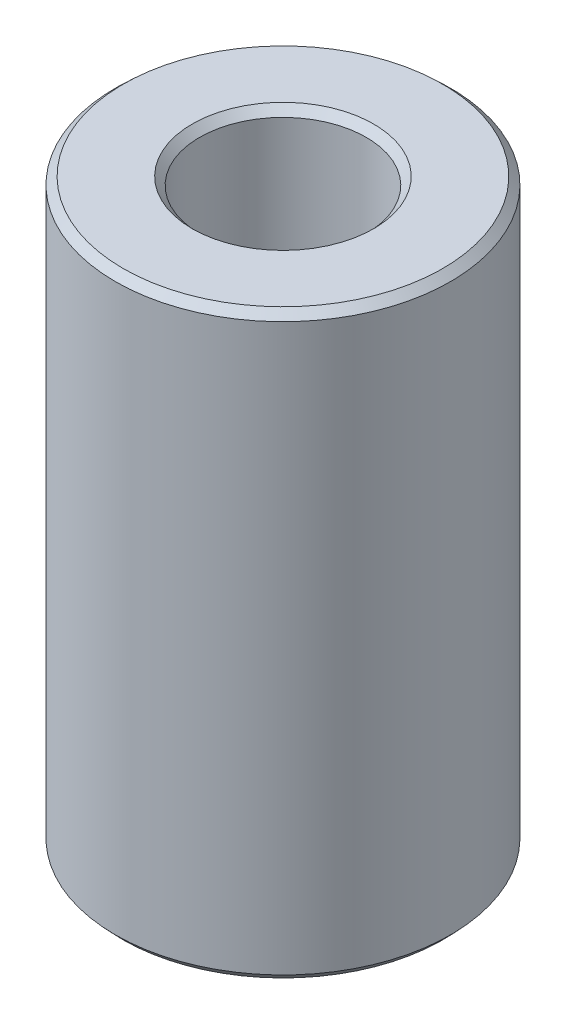
ISO-10303-21;
HEADER;
FILE_DESCRIPTION(('STEP AP214'),'2;1');
FILE_NAME('part.step','',(''),(''),'','','');
FILE_SCHEMA(('AUTOMOTIVE_DESIGN { 1 0 10303 214 1 1 1 1 }'));
ENDSEC;
DATA;
#1=APPLICATION_CONTEXT('core data for automotive mechanical design processes');
#2=APPLICATION_PROTOCOL_DEFINITION('international standard','automotive_design',2000,#1);
#3=PRODUCT_CONTEXT('',#1,'mechanical');
#4=PRODUCT('Part','Part','',(#3));
#5=PRODUCT_RELATED_PRODUCT_CATEGORY('part','',(#4));
#6=PRODUCT_DEFINITION_FORMATION('','',#4);
#7=PRODUCT_DEFINITION_CONTEXT('part definition',#1,'design');
#8=PRODUCT_DEFINITION('design','',#6,#7);
#9=PRODUCT_DEFINITION_SHAPE('','',#8);
#10=(LENGTH_UNIT() NAMED_UNIT(*) SI_UNIT(.MILLI.,.METRE.));
#11=(NAMED_UNIT(*) PLANE_ANGLE_UNIT() SI_UNIT($,.RADIAN.));
#12=(NAMED_UNIT(*) SI_UNIT($,.STERADIAN.) SOLID_ANGLE_UNIT());
#13=UNCERTAINTY_MEASURE_WITH_UNIT(LENGTH_MEASURE(1.E-05),#10,'distance_accuracy_value','');
#14=(GEOMETRIC_REPRESENTATION_CONTEXT(3) GLOBAL_UNCERTAINTY_ASSIGNED_CONTEXT((#13)) GLOBAL_UNIT_ASSIGNED_CONTEXT((#10,
#11,#12)) REPRESENTATION_CONTEXT('',''));
#15=CARTESIAN_POINT('',(0.,0.,0.));
#16=DIRECTION('',(0.,0.,1.));
#17=DIRECTION('',(1.,0.,0.));
#18=AXIS2_PLACEMENT_3D('',#15,#16,#17);
#19=CARTESIAN_POINT('',(0.,17.3345575167335,0.));
#20=DIRECTION('',(0.,-1.,0.));
#21=DIRECTION('',(0.,0.,-1.));
#22=AXIS2_PLACEMENT_3D('',#19,#20,#21);
#23=CYLINDRICAL_SURFACE('',#22,5.);
#24=CARTESIAN_POINT('',(0.,0.234252561759921,0.));
#25=DIRECTION('',(0.,1.,0.));
#26=DIRECTION('',(0.,0.,1.));
#27=AXIS2_PLACEMENT_3D('',#24,#25,#26);
#28=CIRCLE('',#27,5.);
#29=CARTESIAN_POINT('',(0.,0.234252561759921,5.));
#30=VERTEX_POINT('',#29);
#31=EDGE_CURVE('E10',#30,#30,#28,.T.);
#32=ORIENTED_EDGE('',*,*,#31,.T.);
#33=EDGE_LOOP('',(#32));
#34=FACE_BOUND('',#33,.T.);
#35=CARTESIAN_POINT('',(0.,17.1140193628233,0.));
#36=DIRECTION('',(0.,1.,0.));
#37=DIRECTION('',(0.,0.,1.));
#38=AXIS2_PLACEMENT_3D('',#35,#36,#37);
#39=CIRCLE('',#38,5.);
#40=CARTESIAN_POINT('',(0.,17.1140193628233,5.));
#41=VERTEX_POINT('',#40);
#42=EDGE_CURVE('E50',#41,#41,#39,.F.);
#43=ORIENTED_EDGE('',*,*,#42,.T.);
#44=EDGE_LOOP('',(#43));
#45=FACE_BOUND('',#44,.T.);
#46=ADVANCED_FACE('F39',(#34,#45),#23,.T.);
#47=CARTESIAN_POINT('',(0.,17.3345575167335,0.));
#48=DIRECTION('',(0.,1.,0.));
#49=DIRECTION('',(0.,0.,1.));
#50=AXIS2_PLACEMENT_3D('',#47,#48,#49);
#51=PLANE('',#50);
#52=CARTESIAN_POINT('',(0.,17.3345575167335,0.));
#53=DIRECTION('',(0.,1.,0.));
#54=DIRECTION('',(0.,0.,1.));
#55=AXIS2_PLACEMENT_3D('',#52,#53,#54);
#56=CIRCLE('',#55,2.70709384904941);
#57=CARTESIAN_POINT('',(0.,17.3345575167335,2.70709384904941));
#58=VERTEX_POINT('',#57);
#59=EDGE_CURVE('E58',#58,#58,#56,.F.);
#60=ORIENTED_EDGE('',*,*,#59,.T.);
#61=EDGE_LOOP('',(#60));
#62=FACE_BOUND('',#61,.T.);
#63=CARTESIAN_POINT('',(0.,17.3345575167335,0.));
#64=DIRECTION('',(0.,1.,0.));
#65=DIRECTION('',(0.,0.,1.));
#66=AXIS2_PLACEMENT_3D('',#63,#64,#65);
#67=CIRCLE('',#66,4.76574743824008);
#68=CARTESIAN_POINT('',(0.,17.3345575167335,4.76574743824008));
#69=VERTEX_POINT('',#68);
#70=EDGE_CURVE('E61',#69,#69,#67,.T.);
#71=ORIENTED_EDGE('',*,*,#70,.T.);
#72=EDGE_LOOP('',(#71));
#73=FACE_BOUND('',#72,.T.);
#74=ADVANCED_FACE('F88',(#62,#73),#51,.T.);
#75=CARTESIAN_POINT('',(0.,0.,0.));
#76=DIRECTION('',(0.,1.,0.));
#77=DIRECTION('',(0.,0.,1.));
#78=AXIS2_PLACEMENT_3D('',#75,#76,#77);
#79=PLANE('',#78);
#80=CARTESIAN_POINT('',(0.,0.,0.));
#81=DIRECTION('',(0.,1.,0.));
#82=DIRECTION('',(0.,0.,1.));
#83=AXIS2_PLACEMENT_3D('',#80,#81,#82);
#84=CIRCLE('',#83,2.72080825689909);
#85=CARTESIAN_POINT('',(0.,0.,2.72080825689909));
#86=VERTEX_POINT('',#85);
#87=EDGE_CURVE('E51',#86,#86,#84,.T.);
#88=ORIENTED_EDGE('',*,*,#87,.T.);
#89=EDGE_LOOP('',(#88));
#90=FACE_BOUND('',#89,.T.);
#91=CARTESIAN_POINT('',(0.,0.,0.));
#92=DIRECTION('',(0.,1.,0.));
#93=DIRECTION('',(0.,0.,1.));
#94=AXIS2_PLACEMENT_3D('',#91,#92,#93);
#95=CIRCLE('',#94,4.77946184608977);
#96=CARTESIAN_POINT('',(0.,0.,4.77946184608977));
#97=VERTEX_POINT('',#96);
#98=EDGE_CURVE('E54',#97,#97,#95,.F.);
#99=ORIENTED_EDGE('',*,*,#98,.T.);
#100=EDGE_LOOP('',(#99));
#101=FACE_BOUND('',#100,.T.);
#102=ADVANCED_FACE('F83',(#90,#101),#79,.F.);
#103=CARTESIAN_POINT('',(0.,17.3345575167335,0.));
#104=DIRECTION('',(0.,-1.,0.));
#105=DIRECTION('',(0.,0.,-1.));
#106=AXIS2_PLACEMENT_3D('',#103,#104,#105);
#107=CYLINDRICAL_SURFACE('',#106,2.48655569513917);
#108=CARTESIAN_POINT('',(0.,17.1003049549736,0.));
#109=DIRECTION('',(0.,1.,0.));
#110=DIRECTION('',(0.,0.,1.));
#111=AXIS2_PLACEMENT_3D('',#108,#109,#110);
#112=CIRCLE('',#111,2.48655569513917);
#113=CARTESIAN_POINT('',(0.,17.1003049549736,2.48655569513917));
#114=VERTEX_POINT('',#113);
#115=EDGE_CURVE('E67',#114,#114,#112,.T.);
#116=ORIENTED_EDGE('',*,*,#115,.T.);
#117=EDGE_LOOP('',(#116));
#118=FACE_BOUND('',#117,.T.);
#119=CARTESIAN_POINT('',(0.,0.220538153910228,0.));
#120=DIRECTION('',(0.,1.,0.));
#121=DIRECTION('',(0.,0.,1.));
#122=AXIS2_PLACEMENT_3D('',#119,#120,#121);
#123=CIRCLE('',#122,2.48655569513917);
#124=CARTESIAN_POINT('',(0.,0.220538153910228,2.48655569513917));
#125=VERTEX_POINT('',#124);
#126=EDGE_CURVE('E69',#125,#125,#123,.F.);
#127=ORIENTED_EDGE('',*,*,#126,.T.);
#128=EDGE_LOOP('',(#127));
#129=FACE_BOUND('',#128,.T.);
#130=ADVANCED_FACE('F71',(#118,#129),#107,.F.);
#131=CARTESIAN_POINT('',(0.,17.1003049549736,0.));
#132=DIRECTION('',(0.,1.,0.));
#133=DIRECTION('',(0.,0.,1.));
#134=AXIS2_PLACEMENT_3D('',#131,#132,#133);
#135=CONICAL_SURFACE('',#134,2.48655569513917,0.755251872851912);
#136=ORIENTED_EDGE('',*,*,#59,.F.);
#137=EDGE_LOOP('',(#136));
#138=FACE_BOUND('',#137,.T.);
#139=ORIENTED_EDGE('',*,*,#115,.F.);
#140=EDGE_LOOP('',(#139));
#141=FACE_BOUND('',#140,.T.);
#142=ADVANCED_FACE('F77',(#138,#141),#135,.F.);
#143=CARTESIAN_POINT('',(0.,0.,0.));
#144=DIRECTION('',(0.,-1.,0.));
#145=DIRECTION('',(0.,0.,-1.));
#146=AXIS2_PLACEMENT_3D('',#143,#144,#145);
#147=CONICAL_SURFACE('',#146,2.72080825689909,0.815544453942987);
#148=ORIENTED_EDGE('',*,*,#126,.F.);
#149=EDGE_LOOP('',(#148));
#150=FACE_BOUND('',#149,.T.);
#151=ORIENTED_EDGE('',*,*,#87,.F.);
#152=EDGE_LOOP('',(#151));
#153=FACE_BOUND('',#152,.T.);
#154=ADVANCED_FACE('F73',(#150,#153),#147,.F.);
#155=CARTESIAN_POINT('',(0.,0.234252561759921,0.));
#156=DIRECTION('',(0.,1.,0.));
#157=DIRECTION('',(0.,0.,1.));
#158=AXIS2_PLACEMENT_3D('',#155,#156,#157);
#159=CONICAL_SURFACE('',#158,5.,0.755251872851909);
#160=CARTESIAN_POINT('',(0.,0.,4.77946184608977));
#161=CARTESIAN_POINT('',(0.,0.0024401308516656,4.78175911852634));
#162=CARTESIAN_POINT('',(0.,0.00488026170333151,4.7840563909629));
#163=CARTESIAN_POINT('',(0.,0.00976052340666333,4.78865093583603));
#164=CARTESIAN_POINT('',(0.,0.0122006542583292,4.79094820827259));
#165=CARTESIAN_POINT('',(0.,0.0170809159616609,4.79554275314572));
#166=CARTESIAN_POINT('',(0.,0.0195210468133267,4.79784002558229));
#167=CARTESIAN_POINT('',(0.,0.0244013085166584,4.80243457045542));
#168=CARTESIAN_POINT('',(0.,0.0268414393683242,4.80473184289198));
#169=CARTESIAN_POINT('',(0.,0.0317217010716559,4.80932638776511));
#170=CARTESIAN_POINT('',(0.,0.0341618319233216,4.81162366020168));
#171=CARTESIAN_POINT('',(0.,0.0390420936266533,4.81621820507481));
#172=CARTESIAN_POINT('',(0.,0.0414822244783193,4.81851547751137));
#173=CARTESIAN_POINT('',(0.,0.046362486181651,4.8231100223845));
#174=CARTESIAN_POINT('',(0.,0.0488026170333168,4.82540729482107));
#175=CARTESIAN_POINT('',(0.,0.0536828787366484,4.8300018396942));
#176=CARTESIAN_POINT('',(0.,0.0561230095883142,4.83229911213076));
#177=CARTESIAN_POINT('',(0.,0.0610032712916459,4.83689365700389));
#178=CARTESIAN_POINT('',(0.,0.0634434021433118,4.83919092944046));
#179=CARTESIAN_POINT('',(0.,0.0683236638466436,4.84378547431359));
#180=CARTESIAN_POINT('',(0.,0.0707637946983093,4.84608274675015));
#181=CARTESIAN_POINT('',(0.,0.075644056401641,4.85067729162328));
#182=CARTESIAN_POINT('',(0.,0.0780841872533068,4.85297456405985));
#183=CARTESIAN_POINT('',(0.,0.0829644489566385,4.85756910893298));
#184=CARTESIAN_POINT('',(0.,0.0854045798083043,4.85986638136954));
#185=CARTESIAN_POINT('',(0.,0.090284841511636,4.86446092624267));
#186=CARTESIAN_POINT('',(0.,0.0927249723633019,4.86675819867924));
#187=CARTESIAN_POINT('',(0.,0.0976052340666337,4.87135274355237));
#188=CARTESIAN_POINT('',(0.,0.100045364918299,4.87365001598893));
#189=CARTESIAN_POINT('',(0.,0.104925626621631,4.87824456086206));
#190=CARTESIAN_POINT('',(0.,0.107365757473297,4.88054183329863));
#191=CARTESIAN_POINT('',(0.,0.112246019176629,4.88513637817176));
#192=CARTESIAN_POINT('',(0.,0.114686150028295,4.88743365060832));
#193=CARTESIAN_POINT('',(0.,0.119566411731626,4.89202819548145));
#194=CARTESIAN_POINT('',(0.,0.122006542583292,4.89432546791801));
#195=CARTESIAN_POINT('',(0.,0.126886804286624,4.89892001279114));
#196=CARTESIAN_POINT('',(0.,0.129326935138289,4.90121728522771));
#197=CARTESIAN_POINT('',(0.,0.134207196841621,4.90581183010084));
#198=CARTESIAN_POINT('',(0.,0.136647327693287,4.9081091025374));
#199=CARTESIAN_POINT('',(0.,0.141527589396619,4.91270364741053));
#200=CARTESIAN_POINT('',(0.,0.143967720248285,4.9150009198471));
#201=CARTESIAN_POINT('',(0.,0.148847981951616,4.91959546472023));
#202=CARTESIAN_POINT('',(0.,0.151288112803282,4.92189273715679));
#203=CARTESIAN_POINT('',(0.,0.156168374506614,4.92648728202992));
#204=CARTESIAN_POINT('',(0.,0.158608505358279,4.92878455446649));
#205=CARTESIAN_POINT('',(0.,0.163488767061611,4.93337909933962));
#206=CARTESIAN_POINT('',(0.,0.165928897913277,4.93567637177618));
#207=CARTESIAN_POINT('',(0.,0.170809159616609,4.94027091664931));
#208=CARTESIAN_POINT('',(0.,0.173249290468275,4.94256818908588));
#209=CARTESIAN_POINT('',(0.,0.178129552171606,4.94716273395901));
#210=CARTESIAN_POINT('',(0.,0.180569683023272,4.94946000639557));
#211=CARTESIAN_POINT('',(0.,0.185449944726604,4.9540545512687));
#212=CARTESIAN_POINT('',(0.,0.18789007557827,4.95635182370527));
#213=CARTESIAN_POINT('',(0.,0.192770337281601,4.9609463685784));
#214=CARTESIAN_POINT('',(0.,0.195210468133267,4.96324364101496));
#215=CARTESIAN_POINT('',(0.,0.200090729836599,4.96783818588809));
#216=CARTESIAN_POINT('',(0.,0.202530860688265,4.97013545832466));
#217=CARTESIAN_POINT('',(0.,0.207411122391596,4.97473000319779));
#218=CARTESIAN_POINT('',(0.,0.209851253243262,4.97702727563435));
#219=CARTESIAN_POINT('',(0.,0.214731514946594,4.98162182050748));
#220=CARTESIAN_POINT('',(0.,0.21717164579826,4.98391909294405));
#221=CARTESIAN_POINT('',(0.,0.222051907501591,4.98851363781718));
#222=CARTESIAN_POINT('',(0.,0.224492038353257,4.99081091025374));
#223=CARTESIAN_POINT('',(0.,0.229372300056589,4.99540545512687));
#224=CARTESIAN_POINT('',(0.,0.231812430908255,4.99770272756343));
#225=CARTESIAN_POINT('',(0.,0.234252561759921,5.));
#226=B_SPLINE_CURVE_WITH_KNOTS('',3,(#160,#161,#162,#163,#164,#165,#166,#167,#168,#169,#170,
#171,#172,#173,#174,#175,#176,#177,#178,#179,#180,#181,#182,#183,#184,#185,#186,#187,#188,#189,
#190,#191,#192,#193,#194,#195,#196,#197,#198,#199,#200,#201,#202,#203,#204,#205,#206,#207,#208,
#209,#210,#211,#212,#213,#214,#215,#216,#217,#218,#219,#220,#221,#222,#223,#224,#225),
.UNSPECIFIED.,.F.,.F.,(4,2,2,2,2,2,2,2,2,2,2,2,2,2,2,2,2,2,2,2,2,2,2,2,2,2,2,2,2,2,2,2,4),(0.,
0.0100541182104386,0.0201082364208767,0.0301623546313153,0.040216472841754,0.0502705910521926,
0.0603247092626306,0.0703788274730693,0.0804329456835079,0.090487063893946,0.100541182104385,
0.110595300314823,0.120649418525262,0.1307035367357,0.140757654946139,0.150811773156577,
0.160865891367015,0.170920009577454,0.180974127787893,0.191028245998331,0.201082364208769,
0.211136482419208,0.221190600629647,0.231244718840085,0.241298837050523,0.251352955260962,
0.2614070734714,0.271461191681839,0.281515309892277,0.291569428102716,0.301623546313154,
0.311677664523592,0.321731782734031),.UNSPECIFIED.);
#227=EDGE_CURVE('BSEAM76',#97,#30,#226,.T.);
#228=ORIENTED_EDGE('',*,*,#98,.F.);
#229=ORIENTED_EDGE('',*,*,#31,.F.);
#230=ORIENTED_EDGE('',*,*,#227,.T.);
#231=ORIENTED_EDGE('',*,*,#227,.F.);
#232=EDGE_LOOP('',(#228,#230,#229,#231));
#233=FACE_BOUND('',#232,.T.);
#234=ADVANCED_FACE('F76',(#233),#159,.T.);
#235=CARTESIAN_POINT('',(0.,17.3345575167335,0.));
#236=DIRECTION('',(0.,-1.,0.));
#237=DIRECTION('',(0.,0.,-1.));
#238=AXIS2_PLACEMENT_3D('',#235,#236,#237);
#239=CONICAL_SURFACE('',#238,4.76574743824008,0.815544453942984);
#240=ORIENTED_EDGE('',*,*,#42,.F.);
#241=EDGE_LOOP('',(#240));
#242=FACE_BOUND('',#241,.T.);
#243=ORIENTED_EDGE('',*,*,#70,.F.);
#244=EDGE_LOOP('',(#243));
#245=FACE_BOUND('',#244,.T.);
#246=ADVANCED_FACE('F45',(#242,#245),#239,.T.);
#247=CLOSED_SHELL('',(#46,#74,#102,#130,#142,#154,#234,#246));
#248=MANIFOLD_SOLID_BREP('B2',#247);
#249=ADVANCED_BREP_SHAPE_REPRESENTATION('',(#18,#248),#14);
#250=SHAPE_DEFINITION_REPRESENTATION(#9,#249);
ENDSEC;
END-ISO-10303-21;
